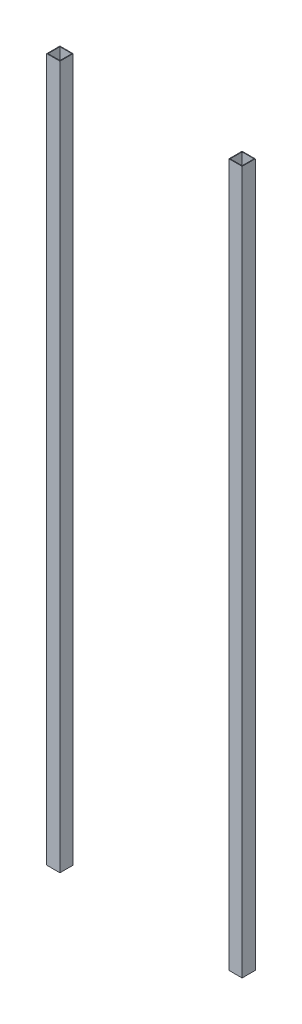
ISO-10303-21;
HEADER;
FILE_DESCRIPTION(('STEP AP214'),'2;1');
FILE_NAME('part.step','',(''),(''),'','','');
FILE_SCHEMA(('AUTOMOTIVE_DESIGN { 1 0 10303 214 1 1 1 1 }'));
ENDSEC;
DATA;
#1=APPLICATION_CONTEXT('core data for automotive mechanical design processes');
#2=APPLICATION_PROTOCOL_DEFINITION('international standard','automotive_design',2000,#1);
#3=PRODUCT_CONTEXT('',#1,'mechanical');
#4=PRODUCT('Part','Part','',(#3));
#5=PRODUCT_RELATED_PRODUCT_CATEGORY('part','',(#4));
#6=PRODUCT_DEFINITION_FORMATION('','',#4);
#7=PRODUCT_DEFINITION_CONTEXT('part definition',#1,'design');
#8=PRODUCT_DEFINITION('design','',#6,#7);
#9=PRODUCT_DEFINITION_SHAPE('','',#8);
#10=(LENGTH_UNIT() NAMED_UNIT(*) SI_UNIT(.MILLI.,.METRE.));
#11=(NAMED_UNIT(*) PLANE_ANGLE_UNIT() SI_UNIT($,.RADIAN.));
#12=(NAMED_UNIT(*) SI_UNIT($,.STERADIAN.) SOLID_ANGLE_UNIT());
#13=UNCERTAINTY_MEASURE_WITH_UNIT(LENGTH_MEASURE(1.E-05),#10,'distance_accuracy_value','');
#14=(GEOMETRIC_REPRESENTATION_CONTEXT(3) GLOBAL_UNCERTAINTY_ASSIGNED_CONTEXT((#13)) GLOBAL_UNIT_ASSIGNED_CONTEXT((#10,
#11,#12)) REPRESENTATION_CONTEXT('',''));
#15=CARTESIAN_POINT('',(0.,0.,0.));
#16=DIRECTION('',(0.,0.,1.));
#17=DIRECTION('',(1.,0.,0.));
#18=AXIS2_PLACEMENT_3D('',#15,#16,#17);
#19=CARTESIAN_POINT('',(0.,1898.65,0.));
#20=DIRECTION('',(0.,-1.,0.));
#21=DIRECTION('',(0.,0.,-1.));
#22=AXIS2_PLACEMENT_3D('',#19,#20,#21);
#23=PLANE('',#22);
#24=DIRECTION('',(0.,0.,-1.));
#25=VECTOR('',#24,1.);
#26=CARTESIAN_POINT('',(526.034,1898.65,1.651));
#27=LINE('',#26,#25);
#28=CARTESIAN_POINT('',(526.034,1898.65,1.651));
#29=VERTEX_POINT('',#28);
#30=CARTESIAN_POINT('',(526.034,1898.65,-33.909));
#31=VERTEX_POINT('',#30);
#32=EDGE_CURVE('E143',#29,#31,#27,.T.);
#33=ORIENTED_EDGE('',*,*,#32,.T.);
#34=DIRECTION('',(-1.,0.,0.));
#35=VECTOR('',#34,1.);
#36=CARTESIAN_POINT('',(490.474,1898.65,-33.909));
#37=LINE('',#36,#35);
#38=CARTESIAN_POINT('',(490.474,1898.65,-33.909));
#39=VERTEX_POINT('',#38);
#40=EDGE_CURVE('E146',#31,#39,#37,.T.);
#41=ORIENTED_EDGE('',*,*,#40,.T.);
#42=DIRECTION('',(0.,0.,1.));
#43=VECTOR('',#42,1.);
#44=CARTESIAN_POINT('',(490.474,1898.65,1.651));
#45=LINE('',#44,#43);
#46=CARTESIAN_POINT('',(490.474,1898.65,1.651));
#47=VERTEX_POINT('',#46);
#48=EDGE_CURVE('E149',#39,#47,#45,.T.);
#49=ORIENTED_EDGE('',*,*,#48,.T.);
#50=DIRECTION('',(1.,0.,0.));
#51=VECTOR('',#50,1.);
#52=CARTESIAN_POINT('',(490.474,1898.65,1.651));
#53=LINE('',#52,#51);
#54=EDGE_CURVE('E151',#47,#29,#53,.T.);
#55=ORIENTED_EDGE('',*,*,#54,.T.);
#56=EDGE_LOOP('',(#33,#41,#49,#55));
#57=FACE_BOUND('',#56,.T.);
#58=DIRECTION('',(0.,0.,-1.));
#59=VECTOR('',#58,1.);
#60=CARTESIAN_POINT('',(524.383,1898.65,0.));
#61=LINE('',#60,#59);
#62=CARTESIAN_POINT('',(524.383,1898.65,0.));
#63=VERTEX_POINT('',#62);
#64=CARTESIAN_POINT('',(524.383,1898.65,-32.258));
#65=VERTEX_POINT('',#64);
#66=EDGE_CURVE('E107',#63,#65,#61,.T.);
#67=ORIENTED_EDGE('',*,*,#66,.F.);
#68=DIRECTION('',(1.,0.,0.));
#69=VECTOR('',#68,1.);
#70=CARTESIAN_POINT('',(492.125,1898.65,0.));
#71=LINE('',#70,#69);
#72=CARTESIAN_POINT('',(492.125,1898.65,0.));
#73=VERTEX_POINT('',#72);
#74=EDGE_CURVE('E129',#73,#63,#71,.T.);
#75=ORIENTED_EDGE('',*,*,#74,.F.);
#76=DIRECTION('',(0.,0.,1.));
#77=VECTOR('',#76,1.);
#78=CARTESIAN_POINT('',(492.125,1898.65,0.));
#79=LINE('',#78,#77);
#80=CARTESIAN_POINT('',(492.125,1898.65,-32.258));
#81=VERTEX_POINT('',#80);
#82=EDGE_CURVE('E127',#81,#73,#79,.T.);
#83=ORIENTED_EDGE('',*,*,#82,.F.);
#84=DIRECTION('',(-1.,0.,0.));
#85=VECTOR('',#84,1.);
#86=CARTESIAN_POINT('',(492.125,1898.65,-32.258));
#87=LINE('',#86,#85);
#88=EDGE_CURVE('E115',#65,#81,#87,.T.);
#89=ORIENTED_EDGE('',*,*,#88,.F.);
#90=EDGE_LOOP('',(#67,#75,#83,#89));
#91=FACE_BOUND('',#90,.T.);
#92=ADVANCED_FACE('F42',(#57,#91),#23,.F.);
#93=CARTESIAN_POINT('',(0.,0.,0.));
#94=DIRECTION('',(0.,-1.,0.));
#95=DIRECTION('',(0.,0.,-1.));
#96=AXIS2_PLACEMENT_3D('',#93,#94,#95);
#97=PLANE('',#96);
#98=DIRECTION('',(0.,0.,-1.));
#99=VECTOR('',#98,1.);
#100=CARTESIAN_POINT('',(526.034,0.,1.651));
#101=LINE('',#100,#99);
#102=CARTESIAN_POINT('',(526.034,0.,1.651));
#103=VERTEX_POINT('',#102);
#104=CARTESIAN_POINT('',(526.034,0.,-33.909));
#105=VERTEX_POINT('',#104);
#106=EDGE_CURVE('E123',#103,#105,#101,.T.);
#107=ORIENTED_EDGE('',*,*,#106,.F.);
#108=DIRECTION('',(1.,0.,0.));
#109=VECTOR('',#108,1.);
#110=CARTESIAN_POINT('',(490.474,0.,1.651));
#111=LINE('',#110,#109);
#112=CARTESIAN_POINT('',(490.474,0.,1.651));
#113=VERTEX_POINT('',#112);
#114=EDGE_CURVE('E147',#113,#103,#111,.T.);
#115=ORIENTED_EDGE('',*,*,#114,.F.);
#116=DIRECTION('',(0.,0.,1.));
#117=VECTOR('',#116,1.);
#118=CARTESIAN_POINT('',(490.474,0.,1.651));
#119=LINE('',#118,#117);
#120=CARTESIAN_POINT('',(490.474,0.,-33.909));
#121=VERTEX_POINT('',#120);
#122=EDGE_CURVE('E158',#121,#113,#119,.T.);
#123=ORIENTED_EDGE('',*,*,#122,.F.);
#124=DIRECTION('',(-1.,0.,0.));
#125=VECTOR('',#124,1.);
#126=CARTESIAN_POINT('',(490.474,0.,-33.909));
#127=LINE('',#126,#125);
#128=EDGE_CURVE('E156',#105,#121,#127,.T.);
#129=ORIENTED_EDGE('',*,*,#128,.F.);
#130=EDGE_LOOP('',(#107,#115,#123,#129));
#131=FACE_BOUND('',#130,.T.);
#132=DIRECTION('',(1.,0.,0.));
#133=VECTOR('',#132,1.);
#134=CARTESIAN_POINT('',(492.125,0.,0.));
#135=LINE('',#134,#133);
#136=CARTESIAN_POINT('',(492.125,0.,0.));
#137=VERTEX_POINT('',#136);
#138=CARTESIAN_POINT('',(524.383,0.,0.));
#139=VERTEX_POINT('',#138);
#140=EDGE_CURVE('E116',#137,#139,#135,.T.);
#141=ORIENTED_EDGE('',*,*,#140,.T.);
#142=DIRECTION('',(0.,0.,-1.));
#143=VECTOR('',#142,1.);
#144=CARTESIAN_POINT('',(524.383,0.,0.));
#145=LINE('',#144,#143);
#146=CARTESIAN_POINT('',(524.383,0.,-32.258));
#147=VERTEX_POINT('',#146);
#148=EDGE_CURVE('E65',#139,#147,#145,.T.);
#149=ORIENTED_EDGE('',*,*,#148,.T.);
#150=DIRECTION('',(-1.,0.,0.));
#151=VECTOR('',#150,1.);
#152=CARTESIAN_POINT('',(492.125,0.,-32.258));
#153=LINE('',#152,#151);
#154=CARTESIAN_POINT('',(492.125,0.,-32.258));
#155=VERTEX_POINT('',#154);
#156=EDGE_CURVE('E122',#147,#155,#153,.T.);
#157=ORIENTED_EDGE('',*,*,#156,.T.);
#158=DIRECTION('',(0.,0.,1.));
#159=VECTOR('',#158,1.);
#160=CARTESIAN_POINT('',(492.125,0.,0.));
#161=LINE('',#160,#159);
#162=EDGE_CURVE('E135',#155,#137,#161,.T.);
#163=ORIENTED_EDGE('',*,*,#162,.T.);
#164=EDGE_LOOP('',(#141,#149,#157,#163));
#165=FACE_BOUND('',#164,.T.);
#166=ADVANCED_FACE('F176',(#131,#165),#97,.T.);
#167=CARTESIAN_POINT('',(526.034,1898.65,1.651));
#168=DIRECTION('',(-1.,0.,0.));
#169=DIRECTION('',(0.,0.,1.));
#170=AXIS2_PLACEMENT_3D('',#167,#168,#169);
#171=PLANE('',#170);
#172=ORIENTED_EDGE('',*,*,#106,.T.);
#173=DIRECTION('',(0.,-1.,0.));
#174=VECTOR('',#173,1.);
#175=CARTESIAN_POINT('',(526.034,1898.65,-33.909));
#176=LINE('',#175,#174);
#177=EDGE_CURVE('E12',#31,#105,#176,.T.);
#178=ORIENTED_EDGE('',*,*,#177,.F.);
#179=ORIENTED_EDGE('',*,*,#32,.F.);
#180=DIRECTION('',(0.,-1.,0.));
#181=VECTOR('',#180,1.);
#182=CARTESIAN_POINT('',(526.034,1898.65,1.651));
#183=LINE('',#182,#181);
#184=EDGE_CURVE('E153',#29,#103,#183,.T.);
#185=ORIENTED_EDGE('',*,*,#184,.T.);
#186=EDGE_LOOP('',(#172,#178,#179,#185));
#187=FACE_BOUND('',#186,.T.);
#188=ADVANCED_FACE('F44',(#187),#171,.F.);
#189=CARTESIAN_POINT('',(490.474,1898.65,-33.909));
#190=DIRECTION('',(0.,0.,1.));
#191=DIRECTION('',(1.,0.,0.));
#192=AXIS2_PLACEMENT_3D('',#189,#190,#191);
#193=PLANE('',#192);
#194=ORIENTED_EDGE('',*,*,#128,.T.);
#195=DIRECTION('',(0.,-1.,0.));
#196=VECTOR('',#195,1.);
#197=CARTESIAN_POINT('',(490.474,1898.65,-33.909));
#198=LINE('',#197,#196);
#199=EDGE_CURVE('E50',#39,#121,#198,.T.);
#200=ORIENTED_EDGE('',*,*,#199,.F.);
#201=ORIENTED_EDGE('',*,*,#40,.F.);
#202=ORIENTED_EDGE('',*,*,#177,.T.);
#203=EDGE_LOOP('',(#194,#200,#201,#202));
#204=FACE_BOUND('',#203,.T.);
#205=ADVANCED_FACE('F186',(#204),#193,.F.);
#206=CARTESIAN_POINT('',(490.474,1898.65,1.651));
#207=DIRECTION('',(1.,0.,0.));
#208=DIRECTION('',(0.,0.,-1.));
#209=AXIS2_PLACEMENT_3D('',#206,#207,#208);
#210=PLANE('',#209);
#211=ORIENTED_EDGE('',*,*,#122,.T.);
#212=DIRECTION('',(0.,-1.,0.));
#213=VECTOR('',#212,1.);
#214=CARTESIAN_POINT('',(490.474,1898.65,1.651));
#215=LINE('',#214,#213);
#216=EDGE_CURVE('E163',#47,#113,#215,.T.);
#217=ORIENTED_EDGE('',*,*,#216,.F.);
#218=ORIENTED_EDGE('',*,*,#48,.F.);
#219=ORIENTED_EDGE('',*,*,#199,.T.);
#220=EDGE_LOOP('',(#211,#217,#218,#219));
#221=FACE_BOUND('',#220,.T.);
#222=ADVANCED_FACE('F170',(#221),#210,.F.);
#223=CARTESIAN_POINT('',(490.474,1898.65,1.651));
#224=DIRECTION('',(0.,0.,-1.));
#225=DIRECTION('',(-1.,0.,0.));
#226=AXIS2_PLACEMENT_3D('',#223,#224,#225);
#227=PLANE('',#226);
#228=ORIENTED_EDGE('',*,*,#114,.T.);
#229=ORIENTED_EDGE('',*,*,#184,.F.);
#230=ORIENTED_EDGE('',*,*,#54,.F.);
#231=ORIENTED_EDGE('',*,*,#216,.T.);
#232=EDGE_LOOP('',(#228,#229,#230,#231));
#233=FACE_BOUND('',#232,.T.);
#234=ADVANCED_FACE('F180',(#233),#227,.F.);
#235=CARTESIAN_POINT('',(524.383,1898.65,0.));
#236=DIRECTION('',(-1.,0.,0.));
#237=DIRECTION('',(0.,0.,1.));
#238=AXIS2_PLACEMENT_3D('',#235,#236,#237);
#239=PLANE('',#238);
#240=ORIENTED_EDGE('',*,*,#148,.F.);
#241=DIRECTION('',(0.,-1.,0.));
#242=VECTOR('',#241,1.);
#243=CARTESIAN_POINT('',(524.383,1898.65,0.));
#244=LINE('',#243,#242);
#245=EDGE_CURVE('E111',#63,#139,#244,.T.);
#246=ORIENTED_EDGE('',*,*,#245,.F.);
#247=ORIENTED_EDGE('',*,*,#66,.T.);
#248=DIRECTION('',(0.,-1.,0.));
#249=VECTOR('',#248,1.);
#250=CARTESIAN_POINT('',(524.383,1898.65,-32.258));
#251=LINE('',#250,#249);
#252=EDGE_CURVE('E110',#65,#147,#251,.T.);
#253=ORIENTED_EDGE('',*,*,#252,.T.);
#254=EDGE_LOOP('',(#240,#246,#247,#253));
#255=FACE_BOUND('',#254,.T.);
#256=ADVANCED_FACE('F109',(#255),#239,.T.);
#257=CARTESIAN_POINT('',(492.125,1898.65,-32.258));
#258=DIRECTION('',(0.,0.,1.));
#259=DIRECTION('',(1.,0.,0.));
#260=AXIS2_PLACEMENT_3D('',#257,#258,#259);
#261=PLANE('',#260);
#262=ORIENTED_EDGE('',*,*,#156,.F.);
#263=ORIENTED_EDGE('',*,*,#252,.F.);
#264=ORIENTED_EDGE('',*,*,#88,.T.);
#265=DIRECTION('',(0.,-1.,0.));
#266=VECTOR('',#265,1.);
#267=CARTESIAN_POINT('',(492.125,1898.65,-32.258));
#268=LINE('',#267,#266);
#269=EDGE_CURVE('E124',#81,#155,#268,.T.);
#270=ORIENTED_EDGE('',*,*,#269,.T.);
#271=EDGE_LOOP('',(#262,#263,#264,#270));
#272=FACE_BOUND('',#271,.T.);
#273=ADVANCED_FACE('F119',(#272),#261,.T.);
#274=CARTESIAN_POINT('',(492.125,1898.65,0.));
#275=DIRECTION('',(1.,0.,0.));
#276=DIRECTION('',(0.,0.,-1.));
#277=AXIS2_PLACEMENT_3D('',#274,#275,#276);
#278=PLANE('',#277);
#279=ORIENTED_EDGE('',*,*,#162,.F.);
#280=ORIENTED_EDGE('',*,*,#269,.F.);
#281=ORIENTED_EDGE('',*,*,#82,.T.);
#282=DIRECTION('',(0.,-1.,0.));
#283=VECTOR('',#282,1.);
#284=CARTESIAN_POINT('',(492.125,1898.65,0.));
#285=LINE('',#284,#283);
#286=EDGE_CURVE('E57',#73,#137,#285,.T.);
#287=ORIENTED_EDGE('',*,*,#286,.T.);
#288=EDGE_LOOP('',(#279,#280,#281,#287));
#289=FACE_BOUND('',#288,.T.);
#290=ADVANCED_FACE('F209',(#289),#278,.T.);
#291=CARTESIAN_POINT('',(492.125,1898.65,0.));
#292=DIRECTION('',(0.,0.,-1.));
#293=DIRECTION('',(-1.,0.,0.));
#294=AXIS2_PLACEMENT_3D('',#291,#292,#293);
#295=PLANE('',#294);
#296=ORIENTED_EDGE('',*,*,#140,.F.);
#297=ORIENTED_EDGE('',*,*,#286,.F.);
#298=ORIENTED_EDGE('',*,*,#74,.T.);
#299=ORIENTED_EDGE('',*,*,#245,.T.);
#300=EDGE_LOOP('',(#296,#297,#298,#299));
#301=FACE_BOUND('',#300,.T.);
#302=ADVANCED_FACE('F213',(#301),#295,.T.);
#303=CLOSED_SHELL('',(#92,#166,#188,#205,#222,#234,#256,#273,#290,#302));
#304=MANIFOLD_SOLID_BREP('B2',#303);
#305=CARTESIAN_POINT('',(0.,1898.65,0.));
#306=DIRECTION('',(0.,1.,0.));
#307=DIRECTION('',(0.,0.,1.));
#308=AXIS2_PLACEMENT_3D('',#305,#306,#307);
#309=PLANE('',#308);
#310=DIRECTION('',(1.,0.,0.));
#311=VECTOR('',#310,1.);
#312=CARTESIAN_POINT('',(-1.651,1898.65,1.651));
#313=LINE('',#312,#311);
#314=CARTESIAN_POINT('',(-1.651,1898.65,1.651));
#315=VERTEX_POINT('',#314);
#316=CARTESIAN_POINT('',(33.909,1898.65,1.651));
#317=VERTEX_POINT('',#316);
#318=EDGE_CURVE('E372',#315,#317,#313,.T.);
#319=ORIENTED_EDGE('',*,*,#318,.T.);
#320=DIRECTION('',(0.,0.,-1.));
#321=VECTOR('',#320,1.);
#322=CARTESIAN_POINT('',(33.909,1898.65,1.651));
#323=LINE('',#322,#321);
#324=CARTESIAN_POINT('',(33.909,1898.65,-33.909));
#325=VERTEX_POINT('',#324);
#326=EDGE_CURVE('E375',#317,#325,#323,.T.);
#327=ORIENTED_EDGE('',*,*,#326,.T.);
#328=DIRECTION('',(-1.,0.,0.));
#329=VECTOR('',#328,1.);
#330=CARTESIAN_POINT('',(-1.651,1898.65,-33.909));
#331=LINE('',#330,#329);
#332=CARTESIAN_POINT('',(-1.651,1898.65,-33.909));
#333=VERTEX_POINT('',#332);
#334=EDGE_CURVE('E378',#325,#333,#331,.T.);
#335=ORIENTED_EDGE('',*,*,#334,.T.);
#336=DIRECTION('',(0.,0.,1.));
#337=VECTOR('',#336,1.);
#338=CARTESIAN_POINT('',(-1.651,1898.65,1.651));
#339=LINE('',#338,#337);
#340=EDGE_CURVE('E380',#333,#315,#339,.T.);
#341=ORIENTED_EDGE('',*,*,#340,.T.);
#342=EDGE_LOOP('',(#319,#327,#335,#341));
#343=FACE_BOUND('',#342,.T.);
#344=DIRECTION('',(1.,0.,0.));
#345=VECTOR('',#344,1.);
#346=CARTESIAN_POINT('',(0.,1898.65,0.));
#347=LINE('',#346,#345);
#348=CARTESIAN_POINT('',(0.,1898.65,0.));
#349=VERTEX_POINT('',#348);
#350=CARTESIAN_POINT('',(32.258,1898.65,0.));
#351=VERTEX_POINT('',#350);
#352=EDGE_CURVE('E344',#349,#351,#347,.T.);
#353=ORIENTED_EDGE('',*,*,#352,.F.);
#354=DIRECTION('',(0.,0.,1.));
#355=VECTOR('',#354,1.);
#356=CARTESIAN_POINT('',(0.,1898.65,0.));
#357=LINE('',#356,#355);
#358=CARTESIAN_POINT('',(0.,1898.65,-32.258));
#359=VERTEX_POINT('',#358);
#360=EDGE_CURVE('E336',#359,#349,#357,.T.);
#361=ORIENTED_EDGE('',*,*,#360,.F.);
#362=DIRECTION('',(-1.,0.,0.));
#363=VECTOR('',#362,1.);
#364=CARTESIAN_POINT('',(0.,1898.65,-32.258));
#365=LINE('',#364,#363);
#366=CARTESIAN_POINT('',(32.258,1898.65,-32.258));
#367=VERTEX_POINT('',#366);
#368=EDGE_CURVE('E358',#367,#359,#365,.T.);
#369=ORIENTED_EDGE('',*,*,#368,.F.);
#370=DIRECTION('',(0.,0.,-1.));
#371=VECTOR('',#370,1.);
#372=CARTESIAN_POINT('',(32.258,1898.65,0.));
#373=LINE('',#372,#371);
#374=EDGE_CURVE('E356',#351,#367,#373,.T.);
#375=ORIENTED_EDGE('',*,*,#374,.F.);
#376=EDGE_LOOP('',(#353,#361,#369,#375));
#377=FACE_BOUND('',#376,.T.);
#378=ADVANCED_FACE('F271',(#343,#377),#309,.T.);
#379=CARTESIAN_POINT('',(0.,0.,0.));
#380=DIRECTION('',(0.,1.,0.));
#381=DIRECTION('',(0.,0.,1.));
#382=AXIS2_PLACEMENT_3D('',#379,#380,#381);
#383=PLANE('',#382);
#384=DIRECTION('',(1.,0.,0.));
#385=VECTOR('',#384,1.);
#386=CARTESIAN_POINT('',(-1.651,0.,1.651));
#387=LINE('',#386,#385);
#388=CARTESIAN_POINT('',(-1.651,0.,1.651));
#389=VERTEX_POINT('',#388);
#390=CARTESIAN_POINT('',(33.909,0.,1.651));
#391=VERTEX_POINT('',#390);
#392=EDGE_CURVE('E352',#389,#391,#387,.T.);
#393=ORIENTED_EDGE('',*,*,#392,.F.);
#394=DIRECTION('',(0.,0.,1.));
#395=VECTOR('',#394,1.);
#396=CARTESIAN_POINT('',(-1.651,0.,1.651));
#397=LINE('',#396,#395);
#398=CARTESIAN_POINT('',(-1.651,0.,-33.909));
#399=VERTEX_POINT('',#398);
#400=EDGE_CURVE('E376',#399,#389,#397,.T.);
#401=ORIENTED_EDGE('',*,*,#400,.F.);
#402=DIRECTION('',(-1.,0.,0.));
#403=VECTOR('',#402,1.);
#404=CARTESIAN_POINT('',(-1.651,0.,-33.909));
#405=LINE('',#404,#403);
#406=CARTESIAN_POINT('',(33.909,0.,-33.909));
#407=VERTEX_POINT('',#406);
#408=EDGE_CURVE('E387',#407,#399,#405,.T.);
#409=ORIENTED_EDGE('',*,*,#408,.F.);
#410=DIRECTION('',(0.,0.,-1.));
#411=VECTOR('',#410,1.);
#412=CARTESIAN_POINT('',(33.909,0.,1.651));
#413=LINE('',#412,#411);
#414=EDGE_CURVE('E385',#391,#407,#413,.T.);
#415=ORIENTED_EDGE('',*,*,#414,.F.);
#416=EDGE_LOOP('',(#393,#401,#409,#415));
#417=FACE_BOUND('',#416,.T.);
#418=DIRECTION('',(0.,0.,1.));
#419=VECTOR('',#418,1.);
#420=CARTESIAN_POINT('',(0.,0.,0.));
#421=LINE('',#420,#419);
#422=CARTESIAN_POINT('',(0.,0.,-32.258));
#423=VERTEX_POINT('',#422);
#424=CARTESIAN_POINT('',(0.,0.,0.));
#425=VERTEX_POINT('',#424);
#426=EDGE_CURVE('E294',#423,#425,#421,.T.);
#427=ORIENTED_EDGE('',*,*,#426,.T.);
#428=DIRECTION('',(1.,0.,0.));
#429=VECTOR('',#428,1.);
#430=CARTESIAN_POINT('',(0.,0.,0.));
#431=LINE('',#430,#429);
#432=CARTESIAN_POINT('',(32.258,0.,0.));
#433=VERTEX_POINT('',#432);
#434=EDGE_CURVE('E351',#425,#433,#431,.T.);
#435=ORIENTED_EDGE('',*,*,#434,.T.);
#436=DIRECTION('',(0.,0.,-1.));
#437=VECTOR('',#436,1.);
#438=CARTESIAN_POINT('',(32.258,0.,0.));
#439=LINE('',#438,#437);
#440=CARTESIAN_POINT('',(32.258,0.,-32.258));
#441=VERTEX_POINT('',#440);
#442=EDGE_CURVE('E364',#433,#441,#439,.T.);
#443=ORIENTED_EDGE('',*,*,#442,.T.);
#444=DIRECTION('',(-1.,0.,0.));
#445=VECTOR('',#444,1.);
#446=CARTESIAN_POINT('',(0.,0.,-32.258));
#447=LINE('',#446,#445);
#448=EDGE_CURVE('E345',#441,#423,#447,.T.);
#449=ORIENTED_EDGE('',*,*,#448,.T.);
#450=EDGE_LOOP('',(#427,#435,#443,#449));
#451=FACE_BOUND('',#450,.T.);
#452=ADVANCED_FACE('F405',(#417,#451),#383,.F.);
#453=CARTESIAN_POINT('',(-1.651,1898.65,1.651));
#454=DIRECTION('',(0.,0.,-1.));
#455=DIRECTION('',(-1.,0.,0.));
#456=AXIS2_PLACEMENT_3D('',#453,#454,#455);
#457=PLANE('',#456);
#458=ORIENTED_EDGE('',*,*,#392,.T.);
#459=DIRECTION('',(0.,-1.,0.));
#460=VECTOR('',#459,1.);
#461=CARTESIAN_POINT('',(33.909,1898.65,1.651));
#462=LINE('',#461,#460);
#463=EDGE_CURVE('E40',#317,#391,#462,.T.);
#464=ORIENTED_EDGE('',*,*,#463,.F.);
#465=ORIENTED_EDGE('',*,*,#318,.F.);
#466=DIRECTION('',(0.,-1.,0.));
#467=VECTOR('',#466,1.);
#468=CARTESIAN_POINT('',(-1.651,1898.65,1.651));
#469=LINE('',#468,#467);
#470=EDGE_CURVE('E382',#315,#389,#469,.T.);
#471=ORIENTED_EDGE('',*,*,#470,.T.);
#472=EDGE_LOOP('',(#458,#464,#465,#471));
#473=FACE_BOUND('',#472,.T.);
#474=ADVANCED_FACE('F273',(#473),#457,.F.);
#475=CARTESIAN_POINT('',(33.909,1898.65,1.651));
#476=DIRECTION('',(-1.,0.,0.));
#477=DIRECTION('',(0.,0.,1.));
#478=AXIS2_PLACEMENT_3D('',#475,#476,#477);
#479=PLANE('',#478);
#480=ORIENTED_EDGE('',*,*,#414,.T.);
#481=DIRECTION('',(0.,-1.,0.));
#482=VECTOR('',#481,1.);
#483=CARTESIAN_POINT('',(33.909,1898.65,-33.909));
#484=LINE('',#483,#482);
#485=EDGE_CURVE('E279',#325,#407,#484,.T.);
#486=ORIENTED_EDGE('',*,*,#485,.F.);
#487=ORIENTED_EDGE('',*,*,#326,.F.);
#488=ORIENTED_EDGE('',*,*,#463,.T.);
#489=EDGE_LOOP('',(#480,#486,#487,#488));
#490=FACE_BOUND('',#489,.T.);
#491=ADVANCED_FACE('F415',(#490),#479,.F.);
#492=CARTESIAN_POINT('',(-1.651,1898.65,-33.909));
#493=DIRECTION('',(0.,0.,1.));
#494=DIRECTION('',(1.,0.,0.));
#495=AXIS2_PLACEMENT_3D('',#492,#493,#494);
#496=PLANE('',#495);
#497=ORIENTED_EDGE('',*,*,#408,.T.);
#498=DIRECTION('',(0.,-1.,0.));
#499=VECTOR('',#498,1.);
#500=CARTESIAN_POINT('',(-1.651,1898.65,-33.909));
#501=LINE('',#500,#499);
#502=EDGE_CURVE('E392',#333,#399,#501,.T.);
#503=ORIENTED_EDGE('',*,*,#502,.F.);
#504=ORIENTED_EDGE('',*,*,#334,.F.);
#505=ORIENTED_EDGE('',*,*,#485,.T.);
#506=EDGE_LOOP('',(#497,#503,#504,#505));
#507=FACE_BOUND('',#506,.T.);
#508=ADVANCED_FACE('F399',(#507),#496,.F.);
#509=CARTESIAN_POINT('',(-1.651,1898.65,1.651));
#510=DIRECTION('',(1.,0.,0.));
#511=DIRECTION('',(0.,0.,-1.));
#512=AXIS2_PLACEMENT_3D('',#509,#510,#511);
#513=PLANE('',#512);
#514=ORIENTED_EDGE('',*,*,#400,.T.);
#515=ORIENTED_EDGE('',*,*,#470,.F.);
#516=ORIENTED_EDGE('',*,*,#340,.F.);
#517=ORIENTED_EDGE('',*,*,#502,.T.);
#518=EDGE_LOOP('',(#514,#515,#516,#517));
#519=FACE_BOUND('',#518,.T.);
#520=ADVANCED_FACE('F409',(#519),#513,.F.);
#521=CARTESIAN_POINT('',(0.,1898.65,0.));
#522=DIRECTION('',(1.,0.,0.));
#523=DIRECTION('',(0.,0.,-1.));
#524=AXIS2_PLACEMENT_3D('',#521,#522,#523);
#525=PLANE('',#524);
#526=ORIENTED_EDGE('',*,*,#426,.F.);
#527=DIRECTION('',(0.,-1.,0.));
#528=VECTOR('',#527,1.);
#529=CARTESIAN_POINT('',(0.,1898.65,-32.258));
#530=LINE('',#529,#528);
#531=EDGE_CURVE('E340',#359,#423,#530,.T.);
#532=ORIENTED_EDGE('',*,*,#531,.F.);
#533=ORIENTED_EDGE('',*,*,#360,.T.);
#534=DIRECTION('',(0.,-1.,0.));
#535=VECTOR('',#534,1.);
#536=CARTESIAN_POINT('',(0.,1898.65,0.));
#537=LINE('',#536,#535);
#538=EDGE_CURVE('E339',#349,#425,#537,.T.);
#539=ORIENTED_EDGE('',*,*,#538,.T.);
#540=EDGE_LOOP('',(#526,#532,#533,#539));
#541=FACE_BOUND('',#540,.T.);
#542=ADVANCED_FACE('F338',(#541),#525,.T.);
#543=CARTESIAN_POINT('',(0.,1898.65,0.));
#544=DIRECTION('',(0.,0.,-1.));
#545=DIRECTION('',(-1.,0.,0.));
#546=AXIS2_PLACEMENT_3D('',#543,#544,#545);
#547=PLANE('',#546);
#548=ORIENTED_EDGE('',*,*,#434,.F.);
#549=ORIENTED_EDGE('',*,*,#538,.F.);
#550=ORIENTED_EDGE('',*,*,#352,.T.);
#551=DIRECTION('',(0.,-1.,0.));
#552=VECTOR('',#551,1.);
#553=CARTESIAN_POINT('',(32.258,1898.65,0.));
#554=LINE('',#553,#552);
#555=EDGE_CURVE('E353',#351,#433,#554,.T.);
#556=ORIENTED_EDGE('',*,*,#555,.T.);
#557=EDGE_LOOP('',(#548,#549,#550,#556));
#558=FACE_BOUND('',#557,.T.);
#559=ADVANCED_FACE('F348',(#558),#547,.T.);
#560=CARTESIAN_POINT('',(32.258,1898.65,0.));
#561=DIRECTION('',(-1.,0.,0.));
#562=DIRECTION('',(0.,0.,1.));
#563=AXIS2_PLACEMENT_3D('',#560,#561,#562);
#564=PLANE('',#563);
#565=ORIENTED_EDGE('',*,*,#442,.F.);
#566=ORIENTED_EDGE('',*,*,#555,.F.);
#567=ORIENTED_EDGE('',*,*,#374,.T.);
#568=DIRECTION('',(0.,-1.,0.));
#569=VECTOR('',#568,1.);
#570=CARTESIAN_POINT('',(32.258,1898.65,-32.258));
#571=LINE('',#570,#569);
#572=EDGE_CURVE('E286',#367,#441,#571,.T.);
#573=ORIENTED_EDGE('',*,*,#572,.T.);
#574=EDGE_LOOP('',(#565,#566,#567,#573));
#575=FACE_BOUND('',#574,.T.);
#576=ADVANCED_FACE('F438',(#575),#564,.T.);
#577=CARTESIAN_POINT('',(0.,1898.65,-32.258));
#578=DIRECTION('',(0.,0.,1.));
#579=DIRECTION('',(1.,0.,0.));
#580=AXIS2_PLACEMENT_3D('',#577,#578,#579);
#581=PLANE('',#580);
#582=ORIENTED_EDGE('',*,*,#448,.F.);
#583=ORIENTED_EDGE('',*,*,#572,.F.);
#584=ORIENTED_EDGE('',*,*,#368,.T.);
#585=ORIENTED_EDGE('',*,*,#531,.T.);
#586=EDGE_LOOP('',(#582,#583,#584,#585));
#587=FACE_BOUND('',#586,.T.);
#588=ADVANCED_FACE('F442',(#587),#581,.T.);
#589=CLOSED_SHELL('',(#378,#452,#474,#491,#508,#520,#542,#559,#576,#588));
#590=MANIFOLD_SOLID_BREP('B6',#589);
#591=ADVANCED_BREP_SHAPE_REPRESENTATION('',(#18,#304,#590),#14);
#592=SHAPE_DEFINITION_REPRESENTATION(#9,#591);
ENDSEC;
END-ISO-10303-21;
